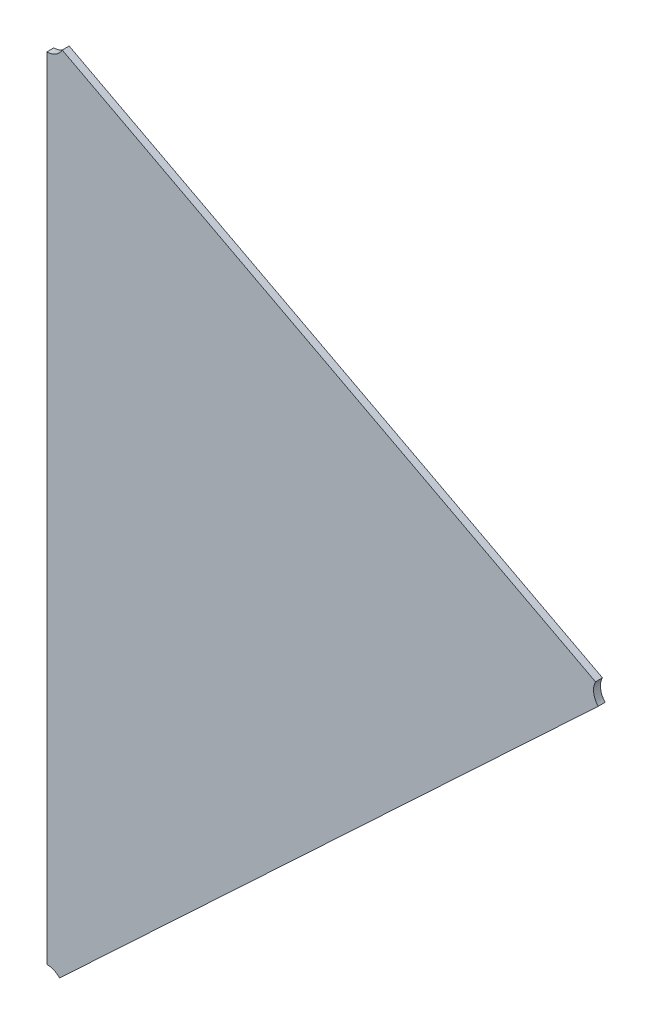
ISO-10303-21;
HEADER;
FILE_DESCRIPTION(('STEP AP214'),'2;1');
FILE_NAME('part.step','',(''),(''),'','','');
FILE_SCHEMA(('AUTOMOTIVE_DESIGN { 1 0 10303 214 1 1 1 1 }'));
ENDSEC;
DATA;
#1=APPLICATION_CONTEXT('core data for automotive mechanical design processes');
#2=APPLICATION_PROTOCOL_DEFINITION('international standard','automotive_design',2000,#1);
#3=PRODUCT_CONTEXT('',#1,'mechanical');
#4=PRODUCT('Part','Part','',(#3));
#5=PRODUCT_RELATED_PRODUCT_CATEGORY('part','',(#4));
#6=PRODUCT_DEFINITION_FORMATION('','',#4);
#7=PRODUCT_DEFINITION_CONTEXT('part definition',#1,'design');
#8=PRODUCT_DEFINITION('design','',#6,#7);
#9=PRODUCT_DEFINITION_SHAPE('','',#8);
#10=(LENGTH_UNIT() NAMED_UNIT(*) SI_UNIT(.MILLI.,.METRE.));
#11=(NAMED_UNIT(*) PLANE_ANGLE_UNIT() SI_UNIT($,.RADIAN.));
#12=(NAMED_UNIT(*) SI_UNIT($,.STERADIAN.) SOLID_ANGLE_UNIT());
#13=UNCERTAINTY_MEASURE_WITH_UNIT(LENGTH_MEASURE(1.E-05),#10,'distance_accuracy_value','');
#14=(GEOMETRIC_REPRESENTATION_CONTEXT(3) GLOBAL_UNCERTAINTY_ASSIGNED_CONTEXT((#13)) GLOBAL_UNIT_ASSIGNED_CONTEXT((#10,
#11,#12)) REPRESENTATION_CONTEXT('',''));
#15=CARTESIAN_POINT('',(0.,0.,0.));
#16=DIRECTION('',(0.,0.,1.));
#17=DIRECTION('',(1.,0.,0.));
#18=AXIS2_PLACEMENT_3D('',#15,#16,#17);
#19=CARTESIAN_POINT('',(-1.65033446435871,-0.918561701377886,0.));
#20=DIRECTION('',(0.,0.,-1.));
#21=DIRECTION('',(-1.,0.,0.));
#22=AXIS2_PLACEMENT_3D('',#19,#20,#21);
#23=PLANE('',#22);
#24=CARTESIAN_POINT('',(-1.7016489577392,-1.04446386523316,0.));
#25=DIRECTION('',(0.,0.,1.));
#26=DIRECTION('',(0.729821846781861,0.683637383383847,0.));
#27=AXIS2_PLACEMENT_3D('',#24,#25,#26);
#28=CIRCLE('',#27,0.00499999999999997);
#29=CARTESIAN_POINT('',(-1.69799984850529,-1.04104567831624,0.));
#30=VERTEX_POINT('',#29);
#31=CARTESIAN_POINT('',(-1.7016489577392,-1.03946386523316,0.));
#32=VERTEX_POINT('',#31);
#33=EDGE_CURVE('E11',#30,#32,#28,.T.);
#34=ORIENTED_EDGE('',*,*,#33,.T.);
#35=DIRECTION('',(0.,1.,0.));
#36=VECTOR('',#35,1.);
#37=CARTESIAN_POINT('',(-1.7016489577392,-1.03946386523316,0.));
#38=LINE('',#37,#36);
#39=CARTESIAN_POINT('',(-1.7016489577392,-0.811521766430921,0.));
#40=VERTEX_POINT('',#39);
#41=EDGE_CURVE('E83',#32,#40,#38,.T.);
#42=ORIENTED_EDGE('',*,*,#41,.T.);
#43=CARTESIAN_POINT('',(-1.7016489577392,-0.806521766430921,0.));
#44=DIRECTION('',(0.,0.,1.));
#45=DIRECTION('',(0.,-1.,0.));
#46=AXIS2_PLACEMENT_3D('',#43,#44,#45);
#47=CIRCLE('',#46,0.00500000000000006);
#48=CARTESIAN_POINT('',(-1.69722376040051,-0.808849346400258,0.));
#49=VERTEX_POINT('',#48);
#50=EDGE_CURVE('E107',#40,#49,#47,.T.);
#51=ORIENTED_EDGE('',*,*,#50,.T.);
#52=DIRECTION('',(0.885039467737862,-0.465515993867323,0.));
#53=VECTOR('',#52,1.);
#54=CARTESIAN_POINT('',(-1.69722376040051,-0.808849346400258,0.));
#55=LINE('',#54,#53);
#56=CARTESIAN_POINT('',(-1.54340111385062,-0.889757492079906,0.));
#57=VERTEX_POINT('',#56);
#58=EDGE_CURVE('E110',#49,#57,#55,.T.);
#59=ORIENTED_EDGE('',*,*,#58,.T.);
#60=CARTESIAN_POINT('',(-1.53897591651193,-0.892085072049242,0.));
#61=DIRECTION('',(0.,0.,1.));
#62=DIRECTION('',(-0.885039467737925,0.465515993867204,0.));
#63=AXIS2_PLACEMENT_3D('',#60,#61,#62);
#64=CIRCLE('',#63,0.00500000000000004);
#65=CARTESIAN_POINT('',(-1.54262502574584,-0.895503258966164,0.));
#66=VERTEX_POINT('',#65);
#67=EDGE_CURVE('E74',#57,#66,#64,.T.);
#68=ORIENTED_EDGE('',*,*,#67,.T.);
#69=DIRECTION('',(-0.729821846781321,-0.683637383384424,0.));
#70=VECTOR('',#69,1.);
#71=CARTESIAN_POINT('',(-1.54262502574584,-0.895503258966166,0.));
#72=LINE('',#71,#70);
#73=EDGE_CURVE('E103',#66,#30,#72,.T.);
#74=ORIENTED_EDGE('',*,*,#73,.T.);
#75=EDGE_LOOP('',(#34,#42,#51,#59,#68,#74));
#76=FACE_BOUND('',#75,.T.);
#77=ADVANCED_FACE('F17',(#76),#23,.T.);
#78=CARTESIAN_POINT('',(-1.7016489577392,-0.806521766430921,0.));
#79=DIRECTION('',(-0.465515993867324,-0.885039467737862,0.));
#80=DIRECTION('',(0.885039467737862,-0.465515993867324,0.));
#81=AXIS2_PLACEMENT_3D('',#78,#79,#80);
#82=PLANE('',#81);
#83=DIRECTION('',(0.,0.,-1.));
#84=VECTOR('',#83,1.);
#85=CARTESIAN_POINT('',(-1.54340111385062,-0.889757492079906,0.002));
#86=LINE('',#85,#84);
#87=CARTESIAN_POINT('',(-1.54340111385062,-0.889757492079906,0.002));
#88=VERTEX_POINT('',#87);
#89=EDGE_CURVE('E24',#88,#57,#86,.T.);
#90=ORIENTED_EDGE('',*,*,#89,.T.);
#91=ORIENTED_EDGE('',*,*,#58,.F.);
#92=DIRECTION('',(0.,0.,1.));
#93=VECTOR('',#92,1.);
#94=CARTESIAN_POINT('',(-1.69722376040051,-0.808849346400258,0.));
#95=LINE('',#94,#93);
#96=CARTESIAN_POINT('',(-1.69722376040051,-0.808849346400258,0.002));
#97=VERTEX_POINT('',#96);
#98=EDGE_CURVE('E68',#49,#97,#95,.T.);
#99=ORIENTED_EDGE('',*,*,#98,.T.);
#100=DIRECTION('',(0.885039467737862,-0.465515993867323,0.));
#101=VECTOR('',#100,1.);
#102=CARTESIAN_POINT('',(-1.69722376040051,-0.808849346400258,0.002));
#103=LINE('',#102,#101);
#104=EDGE_CURVE('E65',#97,#88,#103,.T.);
#105=ORIENTED_EDGE('',*,*,#104,.T.);
#106=EDGE_LOOP('',(#90,#91,#99,#105));
#107=FACE_BOUND('',#106,.T.);
#108=ADVANCED_FACE('F66',(#107),#82,.F.);
#109=CARTESIAN_POINT('',(-1.53897591651193,-0.892085072049242,0.));
#110=DIRECTION('',(-0.683637383384425,0.729821846781321,0.));
#111=DIRECTION('',(-0.729821846781321,-0.683637383384425,0.));
#112=AXIS2_PLACEMENT_3D('',#109,#110,#111);
#113=PLANE('',#112);
#114=DIRECTION('',(0.,0.,-1.));
#115=VECTOR('',#114,1.);
#116=CARTESIAN_POINT('',(-1.69799984850529,-1.04104567831624,0.002));
#117=LINE('',#116,#115);
#118=CARTESIAN_POINT('',(-1.69799984850529,-1.04104567831624,0.002));
#119=VERTEX_POINT('',#118);
#120=EDGE_CURVE('E112',#119,#30,#117,.T.);
#121=ORIENTED_EDGE('',*,*,#120,.T.);
#122=ORIENTED_EDGE('',*,*,#73,.F.);
#123=DIRECTION('',(0.,0.,1.));
#124=VECTOR('',#123,1.);
#125=CARTESIAN_POINT('',(-1.54262502574584,-0.895503258966164,0.));
#126=LINE('',#125,#124);
#127=CARTESIAN_POINT('',(-1.54262502574584,-0.895503258966164,0.002));
#128=VERTEX_POINT('',#127);
#129=EDGE_CURVE('E73',#66,#128,#126,.T.);
#130=ORIENTED_EDGE('',*,*,#129,.T.);
#131=DIRECTION('',(-0.729821846781321,-0.683637383384424,0.));
#132=VECTOR('',#131,1.);
#133=CARTESIAN_POINT('',(-1.54262502574584,-0.895503258966166,0.002));
#134=LINE('',#133,#132);
#135=EDGE_CURVE('E87',#128,#119,#134,.T.);
#136=ORIENTED_EDGE('',*,*,#135,.T.);
#137=EDGE_LOOP('',(#121,#122,#130,#136));
#138=FACE_BOUND('',#137,.T.);
#139=ADVANCED_FACE('F126',(#138),#113,.F.);
#140=CARTESIAN_POINT('',(-1.7016489577392,-1.04446386523316,0.));
#141=DIRECTION('',(1.,0.,0.));
#142=DIRECTION('',(0.,1.,0.));
#143=AXIS2_PLACEMENT_3D('',#140,#141,#142);
#144=PLANE('',#143);
#145=DIRECTION('',(0.,0.,1.));
#146=VECTOR('',#145,1.);
#147=CARTESIAN_POINT('',(-1.7016489577392,-1.03946386523316,0.));
#148=LINE('',#147,#146);
#149=CARTESIAN_POINT('',(-1.7016489577392,-1.03946386523316,0.002));
#150=VERTEX_POINT('',#149);
#151=EDGE_CURVE('E105',#32,#150,#148,.T.);
#152=ORIENTED_EDGE('',*,*,#151,.T.);
#153=DIRECTION('',(0.,1.,0.));
#154=VECTOR('',#153,1.);
#155=CARTESIAN_POINT('',(-1.7016489577392,-1.03946386523316,0.002));
#156=LINE('',#155,#154);
#157=CARTESIAN_POINT('',(-1.7016489577392,-0.811521766430921,0.002));
#158=VERTEX_POINT('',#157);
#159=EDGE_CURVE('E98',#150,#158,#156,.T.);
#160=ORIENTED_EDGE('',*,*,#159,.T.);
#161=DIRECTION('',(0.,0.,-1.));
#162=VECTOR('',#161,1.);
#163=CARTESIAN_POINT('',(-1.7016489577392,-0.811521766430921,0.002));
#164=LINE('',#163,#162);
#165=EDGE_CURVE('E88',#158,#40,#164,.T.);
#166=ORIENTED_EDGE('',*,*,#165,.T.);
#167=ORIENTED_EDGE('',*,*,#41,.F.);
#168=EDGE_LOOP('',(#152,#160,#166,#167));
#169=FACE_BOUND('',#168,.T.);
#170=ADVANCED_FACE('F118',(#169),#144,.F.);
#171=CARTESIAN_POINT('',(-1.65033446435871,-0.918561701377886,0.002));
#172=DIRECTION('',(0.,0.,-1.));
#173=DIRECTION('',(-1.,0.,0.));
#174=AXIS2_PLACEMENT_3D('',#171,#172,#173);
#175=PLANE('',#174);
#176=CARTESIAN_POINT('',(-1.7016489577392,-1.04446386523316,0.002));
#177=DIRECTION('',(0.,0.,-1.));
#178=DIRECTION('',(0.,1.,0.));
#179=AXIS2_PLACEMENT_3D('',#176,#177,#178);
#180=CIRCLE('',#179,0.00499999999999997);
#181=EDGE_CURVE('E100',#150,#119,#180,.T.);
#182=ORIENTED_EDGE('',*,*,#181,.T.);
#183=ORIENTED_EDGE('',*,*,#135,.F.);
#184=CARTESIAN_POINT('',(-1.53897591651193,-0.892085072049242,0.002));
#185=DIRECTION('',(0.,0.,-1.));
#186=DIRECTION('',(-0.729821846781636,-0.683637383384088,0.));
#187=AXIS2_PLACEMENT_3D('',#184,#185,#186);
#188=CIRCLE('',#187,0.00500000000000004);
#189=EDGE_CURVE('E81',#128,#88,#188,.T.);
#190=ORIENTED_EDGE('',*,*,#189,.T.);
#191=ORIENTED_EDGE('',*,*,#104,.F.);
#192=CARTESIAN_POINT('',(-1.7016489577392,-0.806521766430921,0.002));
#193=DIRECTION('',(0.,0.,-1.));
#194=DIRECTION('',(0.88503946773786,-0.465515993867328,0.));
#195=AXIS2_PLACEMENT_3D('',#192,#193,#194);
#196=CIRCLE('',#195,0.00500000000000006);
#197=EDGE_CURVE('E89',#97,#158,#196,.T.);
#198=ORIENTED_EDGE('',*,*,#197,.T.);
#199=ORIENTED_EDGE('',*,*,#159,.F.);
#200=EDGE_LOOP('',(#182,#183,#190,#191,#198,#199));
#201=FACE_BOUND('',#200,.T.);
#202=ADVANCED_FACE('F85',(#201),#175,.F.);
#203=CARTESIAN_POINT('',(-1.7016489577392,-0.806521766430921,0.002));
#204=DIRECTION('',(0.,0.,1.));
#205=DIRECTION('',(-1.,0.,0.));
#206=AXIS2_PLACEMENT_3D('',#203,#204,#205);
#207=CYLINDRICAL_SURFACE('',#206,0.00500000000000006);
#208=ORIENTED_EDGE('',*,*,#98,.F.);
#209=ORIENTED_EDGE('',*,*,#50,.F.);
#210=ORIENTED_EDGE('',*,*,#165,.F.);
#211=ORIENTED_EDGE('',*,*,#197,.F.);
#212=EDGE_LOOP('',(#208,#209,#210,#211));
#213=FACE_BOUND('',#212,.T.);
#214=ADVANCED_FACE('F121',(#213),#207,.F.);
#215=CARTESIAN_POINT('',(-1.53897591651193,-0.892085072049242,0.002));
#216=DIRECTION('',(0.,0.,1.));
#217=DIRECTION('',(-1.,0.,0.));
#218=AXIS2_PLACEMENT_3D('',#215,#216,#217);
#219=CYLINDRICAL_SURFACE('',#218,0.00500000000000004);
#220=ORIENTED_EDGE('',*,*,#89,.F.);
#221=ORIENTED_EDGE('',*,*,#189,.F.);
#222=ORIENTED_EDGE('',*,*,#129,.F.);
#223=ORIENTED_EDGE('',*,*,#67,.F.);
#224=EDGE_LOOP('',(#220,#221,#222,#223));
#225=FACE_BOUND('',#224,.T.);
#226=ADVANCED_FACE('F79',(#225),#219,.F.);
#227=CARTESIAN_POINT('',(-1.7016489577392,-1.04446386523316,0.002));
#228=DIRECTION('',(0.,0.,1.));
#229=DIRECTION('',(-1.,0.,0.));
#230=AXIS2_PLACEMENT_3D('',#227,#228,#229);
#231=CYLINDRICAL_SURFACE('',#230,0.00499999999999997);
#232=ORIENTED_EDGE('',*,*,#120,.F.);
#233=ORIENTED_EDGE('',*,*,#181,.F.);
#234=ORIENTED_EDGE('',*,*,#151,.F.);
#235=ORIENTED_EDGE('',*,*,#33,.F.);
#236=EDGE_LOOP('',(#232,#233,#234,#235));
#237=FACE_BOUND('',#236,.T.);
#238=ADVANCED_FACE('F127',(#237),#231,.F.);
#239=CLOSED_SHELL('',(#77,#108,#139,#170,#202,#214,#226,#238));
#240=MANIFOLD_SOLID_BREP('B1',#239);
#241=ADVANCED_BREP_SHAPE_REPRESENTATION('',(#18,#240),#14);
#242=SHAPE_DEFINITION_REPRESENTATION(#9,#241);
ENDSEC;
END-ISO-10303-21;
